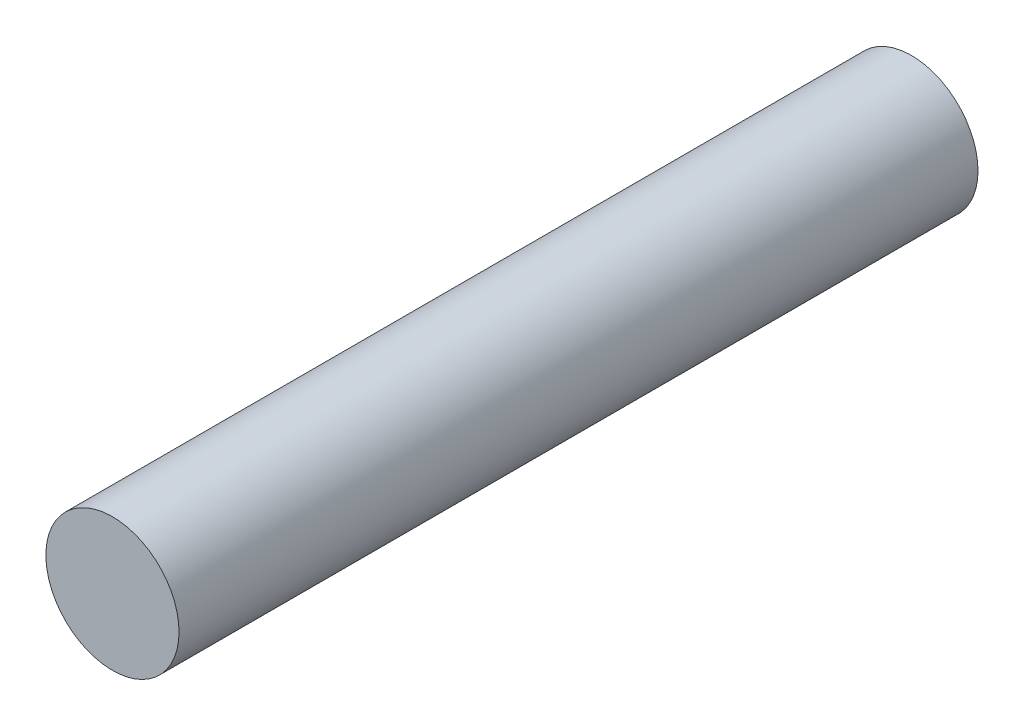
ISO-10303-21;
HEADER;
FILE_DESCRIPTION(('STEP AP214'),'2;1');
FILE_NAME('part.step','',(''),(''),'','','');
FILE_SCHEMA(('AUTOMOTIVE_DESIGN { 1 0 10303 214 1 1 1 1 }'));
ENDSEC;
DATA;
#1=APPLICATION_CONTEXT('core data for automotive mechanical design processes');
#2=APPLICATION_PROTOCOL_DEFINITION('international standard','automotive_design',2000,#1);
#3=PRODUCT_CONTEXT('',#1,'mechanical');
#4=PRODUCT('Part','Part','',(#3));
#5=PRODUCT_RELATED_PRODUCT_CATEGORY('part','',(#4));
#6=PRODUCT_DEFINITION_FORMATION('','',#4);
#7=PRODUCT_DEFINITION_CONTEXT('part definition',#1,'design');
#8=PRODUCT_DEFINITION('design','',#6,#7);
#9=PRODUCT_DEFINITION_SHAPE('','',#8);
#10=(LENGTH_UNIT() NAMED_UNIT(*) SI_UNIT(.MILLI.,.METRE.));
#11=(NAMED_UNIT(*) PLANE_ANGLE_UNIT() SI_UNIT($,.RADIAN.));
#12=(NAMED_UNIT(*) SI_UNIT($,.STERADIAN.) SOLID_ANGLE_UNIT());
#13=UNCERTAINTY_MEASURE_WITH_UNIT(LENGTH_MEASURE(1.E-05),#10,'distance_accuracy_value','');
#14=(GEOMETRIC_REPRESENTATION_CONTEXT(3) GLOBAL_UNCERTAINTY_ASSIGNED_CONTEXT((#13)) GLOBAL_UNIT_ASSIGNED_CONTEXT((#10,
#11,#12)) REPRESENTATION_CONTEXT('',''));
#15=CARTESIAN_POINT('',(0.,0.,0.));
#16=DIRECTION('',(0.,0.,1.));
#17=DIRECTION('',(1.,0.,0.));
#18=AXIS2_PLACEMENT_3D('',#15,#16,#17);
#19=CARTESIAN_POINT('',(0.,0.,38.1));
#20=DIRECTION('',(0.,0.,-1.));
#21=DIRECTION('',(-1.,0.,0.));
#22=AXIS2_PLACEMENT_3D('',#19,#20,#21);
#23=CYLINDRICAL_SURFACE('',#22,3.175);
#24=CARTESIAN_POINT('',(0.,0.,38.1));
#25=DIRECTION('',(0.,0.,1.));
#26=DIRECTION('',(1.,0.,0.));
#27=AXIS2_PLACEMENT_3D('',#24,#25,#26);
#28=CIRCLE('',#27,3.175);
#29=CARTESIAN_POINT('',(3.175,0.,38.1));
#30=VERTEX_POINT('',#29);
#31=EDGE_CURVE('E10',#30,#30,#28,.T.);
#32=ORIENTED_EDGE('',*,*,#31,.F.);
#33=EDGE_LOOP('',(#32));
#34=FACE_BOUND('',#33,.T.);
#35=CARTESIAN_POINT('',(0.,0.,0.));
#36=DIRECTION('',(0.,0.,1.));
#37=DIRECTION('',(1.,0.,0.));
#38=AXIS2_PLACEMENT_3D('',#35,#36,#37);
#39=CIRCLE('',#38,3.175);
#40=CARTESIAN_POINT('',(3.175,0.,0.));
#41=VERTEX_POINT('',#40);
#42=EDGE_CURVE('E40',#41,#41,#39,.T.);
#43=ORIENTED_EDGE('',*,*,#42,.T.);
#44=EDGE_LOOP('',(#43));
#45=FACE_BOUND('',#44,.T.);
#46=ADVANCED_FACE('F37',(#34,#45),#23,.T.);
#47=CARTESIAN_POINT('',(0.,0.,38.1));
#48=DIRECTION('',(0.,0.,1.));
#49=DIRECTION('',(1.,0.,0.));
#50=AXIS2_PLACEMENT_3D('',#47,#48,#49);
#51=PLANE('',#50);
#52=ORIENTED_EDGE('',*,*,#31,.T.);
#53=EDGE_LOOP('',(#52));
#54=FACE_BOUND('',#53,.T.);
#55=ADVANCED_FACE('F54',(#54),#51,.T.);
#56=CARTESIAN_POINT('',(0.,0.,0.));
#57=DIRECTION('',(0.,0.,1.));
#58=DIRECTION('',(1.,0.,0.));
#59=AXIS2_PLACEMENT_3D('',#56,#57,#58);
#60=PLANE('',#59);
#61=ORIENTED_EDGE('',*,*,#42,.F.);
#62=EDGE_LOOP('',(#61));
#63=FACE_BOUND('',#62,.T.);
#64=ADVANCED_FACE('F52',(#63),#60,.F.);
#65=CLOSED_SHELL('',(#46,#55,#64));
#66=MANIFOLD_SOLID_BREP('B2',#65);
#67=ADVANCED_BREP_SHAPE_REPRESENTATION('',(#18,#66),#14);
#68=SHAPE_DEFINITION_REPRESENTATION(#9,#67);
ENDSEC;
END-ISO-10303-21;
